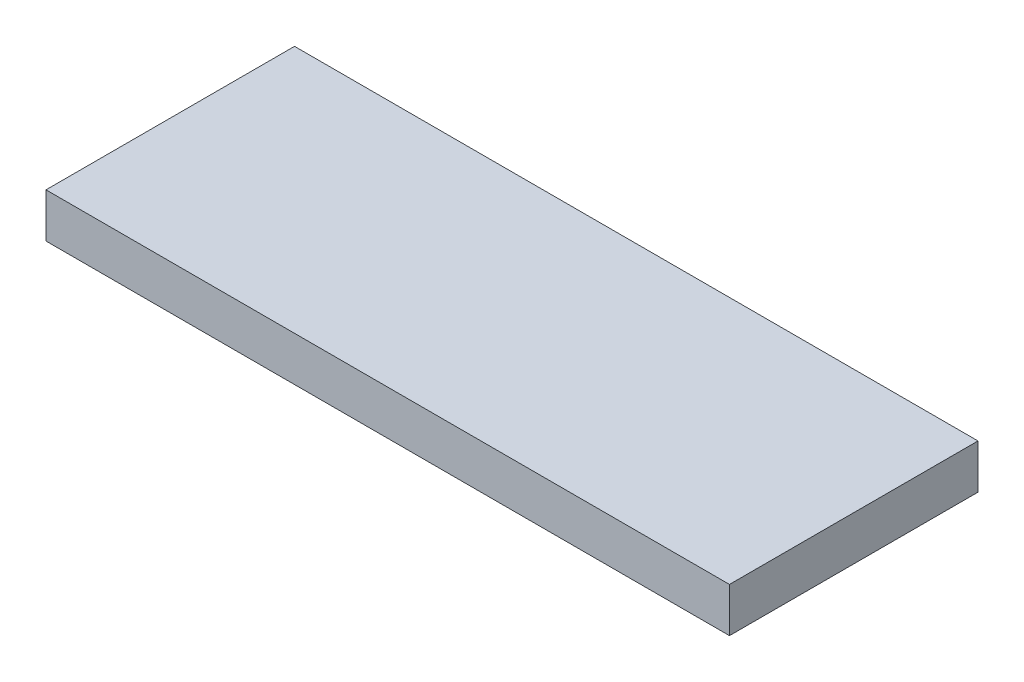
ISO-10303-21;
HEADER;
FILE_DESCRIPTION(('STEP AP214'),'2;1');
FILE_NAME('part.step','',(''),(''),'','','');
FILE_SCHEMA(('AUTOMOTIVE_DESIGN { 1 0 10303 214 1 1 1 1 }'));
ENDSEC;
DATA;
#1=APPLICATION_CONTEXT('core data for automotive mechanical design processes');
#2=APPLICATION_PROTOCOL_DEFINITION('international standard','automotive_design',2000,#1);
#3=PRODUCT_CONTEXT('',#1,'mechanical');
#4=PRODUCT('Part','Part','',(#3));
#5=PRODUCT_RELATED_PRODUCT_CATEGORY('part','',(#4));
#6=PRODUCT_DEFINITION_FORMATION('','',#4);
#7=PRODUCT_DEFINITION_CONTEXT('part definition',#1,'design');
#8=PRODUCT_DEFINITION('design','',#6,#7);
#9=PRODUCT_DEFINITION_SHAPE('','',#8);
#10=(LENGTH_UNIT() NAMED_UNIT(*) SI_UNIT(.MILLI.,.METRE.));
#11=(NAMED_UNIT(*) PLANE_ANGLE_UNIT() SI_UNIT($,.RADIAN.));
#12=(NAMED_UNIT(*) SI_UNIT($,.STERADIAN.) SOLID_ANGLE_UNIT());
#13=UNCERTAINTY_MEASURE_WITH_UNIT(LENGTH_MEASURE(1.E-05),#10,'distance_accuracy_value','');
#14=(GEOMETRIC_REPRESENTATION_CONTEXT(3) GLOBAL_UNCERTAINTY_ASSIGNED_CONTEXT((#13)) GLOBAL_UNIT_ASSIGNED_CONTEXT((#10,
#11,#12)) REPRESENTATION_CONTEXT('',''));
#15=CARTESIAN_POINT('',(0.,0.,0.));
#16=DIRECTION('',(0.,0.,1.));
#17=DIRECTION('',(1.,0.,0.));
#18=AXIS2_PLACEMENT_3D('',#15,#16,#17);
#19=CARTESIAN_POINT('',(77.,10.,-28.));
#20=DIRECTION('',(1.,0.,0.));
#21=DIRECTION('',(0.,0.,-1.));
#22=AXIS2_PLACEMENT_3D('',#19,#20,#21);
#23=PLANE('',#22);
#24=DIRECTION('',(0.,0.,1.));
#25=VECTOR('',#24,1.);
#26=CARTESIAN_POINT('',(77.,0.,-28.));
#27=LINE('',#26,#25);
#28=CARTESIAN_POINT('',(77.,0.,-28.));
#29=VERTEX_POINT('',#28);
#30=CARTESIAN_POINT('',(77.,0.,28.));
#31=VERTEX_POINT('',#30);
#32=EDGE_CURVE('E94',#29,#31,#27,.T.);
#33=ORIENTED_EDGE('',*,*,#32,.F.);
#34=DIRECTION('',(0.,-1.,0.));
#35=VECTOR('',#34,1.);
#36=CARTESIAN_POINT('',(77.,10.,-28.));
#37=LINE('',#36,#35);
#38=CARTESIAN_POINT('',(77.,10.,-28.));
#39=VERTEX_POINT('',#38);
#40=EDGE_CURVE('E11',#39,#29,#37,.T.);
#41=ORIENTED_EDGE('',*,*,#40,.F.);
#42=DIRECTION('',(0.,0.,1.));
#43=VECTOR('',#42,1.);
#44=CARTESIAN_POINT('',(77.,10.,-28.));
#45=LINE('',#44,#43);
#46=CARTESIAN_POINT('',(77.,10.,28.));
#47=VERTEX_POINT('',#46);
#48=EDGE_CURVE('E97',#39,#47,#45,.T.);
#49=ORIENTED_EDGE('',*,*,#48,.T.);
#50=DIRECTION('',(0.,-1.,0.));
#51=VECTOR('',#50,1.);
#52=CARTESIAN_POINT('',(77.,10.,28.));
#53=LINE('',#52,#51);
#54=EDGE_CURVE('E38',#47,#31,#53,.T.);
#55=ORIENTED_EDGE('',*,*,#54,.T.);
#56=EDGE_LOOP('',(#33,#41,#49,#55));
#57=FACE_BOUND('',#56,.T.);
#58=ADVANCED_FACE('F35',(#57),#23,.T.);
#59=CARTESIAN_POINT('',(77.,10.,-28.));
#60=DIRECTION('',(0.,0.,1.));
#61=DIRECTION('',(1.,0.,0.));
#62=AXIS2_PLACEMENT_3D('',#59,#60,#61);
#63=PLANE('',#62);
#64=DIRECTION('',(-1.,0.,0.));
#65=VECTOR('',#64,1.);
#66=CARTESIAN_POINT('',(77.,0.,-28.));
#67=LINE('',#66,#65);
#68=CARTESIAN_POINT('',(-77.,0.,-28.));
#69=VERTEX_POINT('',#68);
#70=EDGE_CURVE('E69',#29,#69,#67,.T.);
#71=ORIENTED_EDGE('',*,*,#70,.T.);
#72=DIRECTION('',(0.,-1.,0.));
#73=VECTOR('',#72,1.);
#74=CARTESIAN_POINT('',(-77.,10.,-28.));
#75=LINE('',#74,#73);
#76=CARTESIAN_POINT('',(-77.,10.,-28.));
#77=VERTEX_POINT('',#76);
#78=EDGE_CURVE('E44',#77,#69,#75,.T.);
#79=ORIENTED_EDGE('',*,*,#78,.F.);
#80=DIRECTION('',(-1.,0.,0.));
#81=VECTOR('',#80,1.);
#82=CARTESIAN_POINT('',(77.,10.,-28.));
#83=LINE('',#82,#81);
#84=EDGE_CURVE('E103',#39,#77,#83,.T.);
#85=ORIENTED_EDGE('',*,*,#84,.F.);
#86=ORIENTED_EDGE('',*,*,#40,.T.);
#87=EDGE_LOOP('',(#71,#79,#85,#86));
#88=FACE_BOUND('',#87,.T.);
#89=ADVANCED_FACE('F124',(#88),#63,.F.);
#90=CARTESIAN_POINT('',(-77.,10.,-28.));
#91=DIRECTION('',(1.,0.,0.));
#92=DIRECTION('',(0.,0.,-1.));
#93=AXIS2_PLACEMENT_3D('',#90,#91,#92);
#94=PLANE('',#93);
#95=DIRECTION('',(0.,0.,1.));
#96=VECTOR('',#95,1.);
#97=CARTESIAN_POINT('',(-77.,0.,-28.));
#98=LINE('',#97,#96);
#99=CARTESIAN_POINT('',(-77.,0.,28.));
#100=VERTEX_POINT('',#99);
#101=EDGE_CURVE('E110',#69,#100,#98,.T.);
#102=ORIENTED_EDGE('',*,*,#101,.T.);
#103=DIRECTION('',(0.,-1.,0.));
#104=VECTOR('',#103,1.);
#105=CARTESIAN_POINT('',(-77.,10.,28.));
#106=LINE('',#105,#104);
#107=CARTESIAN_POINT('',(-77.,10.,28.));
#108=VERTEX_POINT('',#107);
#109=EDGE_CURVE('E114',#108,#100,#106,.T.);
#110=ORIENTED_EDGE('',*,*,#109,.F.);
#111=DIRECTION('',(0.,0.,1.));
#112=VECTOR('',#111,1.);
#113=CARTESIAN_POINT('',(-77.,10.,-28.));
#114=LINE('',#113,#112);
#115=EDGE_CURVE('E101',#77,#108,#114,.T.);
#116=ORIENTED_EDGE('',*,*,#115,.F.);
#117=ORIENTED_EDGE('',*,*,#78,.T.);
#118=EDGE_LOOP('',(#102,#110,#116,#117));
#119=FACE_BOUND('',#118,.T.);
#120=ADVANCED_FACE('F122',(#119),#94,.F.);
#121=CARTESIAN_POINT('',(77.,10.,28.));
#122=DIRECTION('',(0.,0.,1.));
#123=DIRECTION('',(1.,0.,0.));
#124=AXIS2_PLACEMENT_3D('',#121,#122,#123);
#125=PLANE('',#124);
#126=DIRECTION('',(-1.,0.,0.));
#127=VECTOR('',#126,1.);
#128=CARTESIAN_POINT('',(77.,0.,28.));
#129=LINE('',#128,#127);
#130=EDGE_CURVE('E107',#31,#100,#129,.T.);
#131=ORIENTED_EDGE('',*,*,#130,.F.);
#132=ORIENTED_EDGE('',*,*,#54,.F.);
#133=DIRECTION('',(-1.,0.,0.));
#134=VECTOR('',#133,1.);
#135=CARTESIAN_POINT('',(77.,10.,28.));
#136=LINE('',#135,#134);
#137=EDGE_CURVE('E99',#47,#108,#136,.T.);
#138=ORIENTED_EDGE('',*,*,#137,.T.);
#139=ORIENTED_EDGE('',*,*,#109,.T.);
#140=EDGE_LOOP('',(#131,#132,#138,#139));
#141=FACE_BOUND('',#140,.T.);
#142=ADVANCED_FACE('F117',(#141),#125,.T.);
#143=CARTESIAN_POINT('',(0.,10.,0.));
#144=DIRECTION('',(0.,-1.,0.));
#145=DIRECTION('',(0.,0.,-1.));
#146=AXIS2_PLACEMENT_3D('',#143,#144,#145);
#147=PLANE('',#146);
#148=ORIENTED_EDGE('',*,*,#48,.F.);
#149=ORIENTED_EDGE('',*,*,#84,.T.);
#150=ORIENTED_EDGE('',*,*,#115,.T.);
#151=ORIENTED_EDGE('',*,*,#137,.F.);
#152=EDGE_LOOP('',(#148,#149,#150,#151));
#153=FACE_BOUND('',#152,.T.);
#154=ADVANCED_FACE('F126',(#153),#147,.F.);
#155=CARTESIAN_POINT('',(0.,0.,0.));
#156=DIRECTION('',(0.,-1.,0.));
#157=DIRECTION('',(0.,0.,-1.));
#158=AXIS2_PLACEMENT_3D('',#155,#156,#157);
#159=PLANE('',#158);
#160=CARTESIAN_POINT('',(0.,0.,0.));
#161=DIRECTION('',(0.,1.,0.));
#162=DIRECTION('',(0.,0.,1.));
#163=AXIS2_PLACEMENT_3D('',#160,#161,#162);
#164=CIRCLE('',#163,3.);
#165=CARTESIAN_POINT('',(0.,0.,3.));
#166=VERTEX_POINT('',#165);
#167=EDGE_CURVE('E91',#166,#166,#164,.T.);
#168=ORIENTED_EDGE('',*,*,#167,.T.);
#169=EDGE_LOOP('',(#168));
#170=FACE_BOUND('',#169,.T.);
#171=ORIENTED_EDGE('',*,*,#32,.T.);
#172=ORIENTED_EDGE('',*,*,#130,.T.);
#173=ORIENTED_EDGE('',*,*,#101,.F.);
#174=ORIENTED_EDGE('',*,*,#70,.F.);
#175=EDGE_LOOP('',(#171,#172,#173,#174));
#176=FACE_BOUND('',#175,.T.);
#177=ADVANCED_FACE('F120',(#170,#176),#159,.T.);
#178=CARTESIAN_POINT('',(0.,3.7320508075689,0.));
#179=DIRECTION('',(0.,1.,0.));
#180=DIRECTION('',(0.,0.,1.));
#181=AXIS2_PLACEMENT_3D('',#178,#179,#180);
#182=CYLINDRICAL_SURFACE('',#181,3.);
#183=CARTESIAN_POINT('',(0.,2.,0.));
#184=DIRECTION('',(0.,1.,0.));
#185=DIRECTION('',(0.,0.,1.));
#186=AXIS2_PLACEMENT_3D('',#183,#184,#185);
#187=CIRCLE('',#186,3.);
#188=CARTESIAN_POINT('',(0.,2.,3.));
#189=VERTEX_POINT('',#188);
#190=EDGE_CURVE('E89',#189,#189,#187,.T.);
#191=ORIENTED_EDGE('',*,*,#190,.T.);
#192=EDGE_LOOP('',(#191));
#193=FACE_BOUND('',#192,.T.);
#194=ORIENTED_EDGE('',*,*,#167,.F.);
#195=EDGE_LOOP('',(#194));
#196=FACE_BOUND('',#195,.T.);
#197=ADVANCED_FACE('F85',(#193,#196),#182,.F.);
#198=CARTESIAN_POINT('',(0.,2.,0.));
#199=DIRECTION('',(0.,-1.,0.));
#200=DIRECTION('',(0.,0.,-1.));
#201=AXIS2_PLACEMENT_3D('',#198,#199,#200);
#202=CONICAL_SURFACE('',#201,3.,1.04719755119659);
#203=CARTESIAN_POINT('',(0.,3.7320508075689,0.));
#204=VERTEX_POINT('',#203);
#205=VERTEX_LOOP('',#204);
#206=FACE_BOUND('',#205,.T.);
#207=ORIENTED_EDGE('',*,*,#190,.F.);
#208=EDGE_LOOP('',(#207));
#209=FACE_BOUND('',#208,.T.);
#210=ADVANCED_FACE('F82',(#206,#209),#202,.F.);
#211=CLOSED_SHELL('',(#58,#89,#120,#142,#154,#177,#197,#210));
#212=MANIFOLD_SOLID_BREP('B2',#211);
#213=ADVANCED_BREP_SHAPE_REPRESENTATION('',(#18,#212),#14);
#214=SHAPE_DEFINITION_REPRESENTATION(#9,#213);
ENDSEC;
END-ISO-10303-21;
